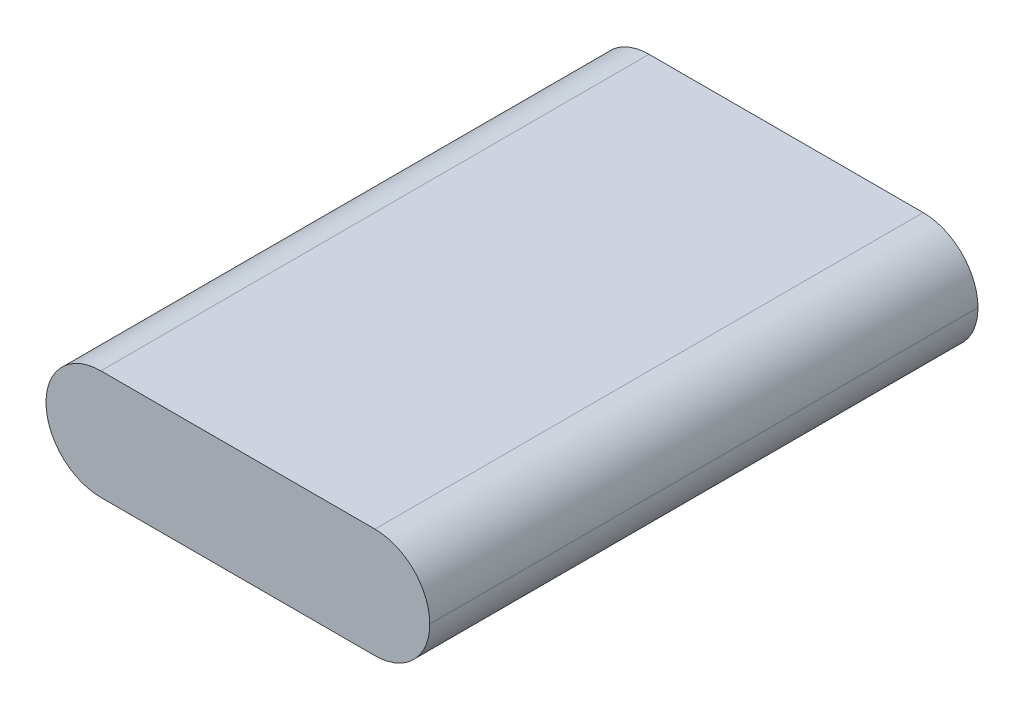
ISO-10303-21;
HEADER;
FILE_DESCRIPTION(('STEP AP214'),'2;1');
FILE_NAME('part.step','',(''),(''),'','','');
FILE_SCHEMA(('AUTOMOTIVE_DESIGN { 1 0 10303 214 1 1 1 1 }'));
ENDSEC;
DATA;
#1=APPLICATION_CONTEXT('core data for automotive mechanical design processes');
#2=APPLICATION_PROTOCOL_DEFINITION('international standard','automotive_design',2000,#1);
#3=PRODUCT_CONTEXT('',#1,'mechanical');
#4=PRODUCT('Part','Part','',(#3));
#5=PRODUCT_RELATED_PRODUCT_CATEGORY('part','',(#4));
#6=PRODUCT_DEFINITION_FORMATION('','',#4);
#7=PRODUCT_DEFINITION_CONTEXT('part definition',#1,'design');
#8=PRODUCT_DEFINITION('design','',#6,#7);
#9=PRODUCT_DEFINITION_SHAPE('','',#8);
#10=(LENGTH_UNIT() NAMED_UNIT(*) SI_UNIT(.MILLI.,.METRE.));
#11=(NAMED_UNIT(*) PLANE_ANGLE_UNIT() SI_UNIT($,.RADIAN.));
#12=(NAMED_UNIT(*) SI_UNIT($,.STERADIAN.) SOLID_ANGLE_UNIT());
#13=UNCERTAINTY_MEASURE_WITH_UNIT(LENGTH_MEASURE(1.E-05),#10,'distance_accuracy_value','');
#14=(GEOMETRIC_REPRESENTATION_CONTEXT(3) GLOBAL_UNCERTAINTY_ASSIGNED_CONTEXT((#13)) GLOBAL_UNIT_ASSIGNED_CONTEXT((#10,
#11,#12)) REPRESENTATION_CONTEXT('',''));
#15=CARTESIAN_POINT('',(0.,0.,0.));
#16=DIRECTION('',(0.,0.,1.));
#17=DIRECTION('',(1.,0.,0.));
#18=AXIS2_PLACEMENT_3D('',#15,#16,#17);
#19=CARTESIAN_POINT('',(17.5,10.,25.));
#20=DIRECTION('',(0.,0.,-1.));
#21=DIRECTION('',(-1.,0.,0.));
#22=AXIS2_PLACEMENT_3D('',#19,#20,#21);
#23=PLANE('',#22);
#24=CARTESIAN_POINT('',(-12.5,5.,25.));
#25=DIRECTION('',(0.,0.,-1.));
#26=DIRECTION('',(-1.,0.,0.));
#27=AXIS2_PLACEMENT_3D('',#24,#25,#26);
#28=CIRCLE('',#27,5.);
#29=CARTESIAN_POINT('',(-12.5,10.,25.));
#30=VERTEX_POINT('',#29);
#31=CARTESIAN_POINT('',(-17.5,5.,25.));
#32=VERTEX_POINT('',#31);
#33=EDGE_CURVE('E94',#30,#32,#28,.F.);
#34=ORIENTED_EDGE('',*,*,#33,.T.);
#35=CARTESIAN_POINT('',(-12.5,5.,25.));
#36=DIRECTION('',(0.,0.,-1.));
#37=DIRECTION('',(-1.,0.,0.));
#38=AXIS2_PLACEMENT_3D('',#35,#36,#37);
#39=CIRCLE('',#38,5.);
#40=CARTESIAN_POINT('',(-12.5,0.,25.));
#41=VERTEX_POINT('',#40);
#42=EDGE_CURVE('E89',#32,#41,#39,.F.);
#43=ORIENTED_EDGE('',*,*,#42,.T.);
#44=DIRECTION('',(1.,0.,0.));
#45=VECTOR('',#44,1.);
#46=CARTESIAN_POINT('',(17.5,0.,25.));
#47=LINE('',#46,#45);
#48=CARTESIAN_POINT('',(12.5,0.,25.));
#49=VERTEX_POINT('',#48);
#50=EDGE_CURVE('E91',#41,#49,#47,.T.);
#51=ORIENTED_EDGE('',*,*,#50,.T.);
#52=CARTESIAN_POINT('',(12.5,5.,25.));
#53=DIRECTION('',(0.,0.,-1.));
#54=DIRECTION('',(-1.,0.,0.));
#55=AXIS2_PLACEMENT_3D('',#52,#53,#54);
#56=CIRCLE('',#55,5.);
#57=CARTESIAN_POINT('',(17.5,5.,25.));
#58=VERTEX_POINT('',#57);
#59=EDGE_CURVE('E126',#49,#58,#56,.F.);
#60=ORIENTED_EDGE('',*,*,#59,.T.);
#61=CARTESIAN_POINT('',(12.5,5.,25.));
#62=DIRECTION('',(0.,0.,-1.));
#63=DIRECTION('',(-1.,0.,0.));
#64=AXIS2_PLACEMENT_3D('',#61,#62,#63);
#65=CIRCLE('',#64,5.);
#66=CARTESIAN_POINT('',(12.5,10.,25.));
#67=VERTEX_POINT('',#66);
#68=EDGE_CURVE('E130',#58,#67,#65,.F.);
#69=ORIENTED_EDGE('',*,*,#68,.T.);
#70=DIRECTION('',(1.,0.,0.));
#71=VECTOR('',#70,1.);
#72=CARTESIAN_POINT('',(17.5,10.,25.));
#73=LINE('',#72,#71);
#74=EDGE_CURVE('E135',#30,#67,#73,.T.);
#75=ORIENTED_EDGE('',*,*,#74,.F.);
#76=EDGE_LOOP('',(#34,#43,#51,#60,#69,#75));
#77=FACE_BOUND('',#76,.T.);
#78=ADVANCED_FACE('F35',(#77),#23,.F.);
#79=CARTESIAN_POINT('',(17.5,10.,-25.));
#80=DIRECTION('',(0.,0.,1.));
#81=DIRECTION('',(1.,0.,0.));
#82=AXIS2_PLACEMENT_3D('',#79,#80,#81);
#83=PLANE('',#82);
#84=DIRECTION('',(-1.,0.,0.));
#85=VECTOR('',#84,1.);
#86=CARTESIAN_POINT('',(17.5,0.,-25.));
#87=LINE('',#86,#85);
#88=CARTESIAN_POINT('',(12.5,0.,-25.));
#89=VERTEX_POINT('',#88);
#90=CARTESIAN_POINT('',(-12.5,0.,-25.));
#91=VERTEX_POINT('',#90);
#92=EDGE_CURVE('E109',#89,#91,#87,.T.);
#93=ORIENTED_EDGE('',*,*,#92,.T.);
#94=CARTESIAN_POINT('',(-12.5,5.,-25.));
#95=DIRECTION('',(0.,0.,1.));
#96=DIRECTION('',(1.,0.,0.));
#97=AXIS2_PLACEMENT_3D('',#94,#95,#96);
#98=CIRCLE('',#97,5.);
#99=CARTESIAN_POINT('',(-17.5,5.,-25.));
#100=VERTEX_POINT('',#99);
#101=EDGE_CURVE('E113',#91,#100,#98,.F.);
#102=ORIENTED_EDGE('',*,*,#101,.T.);
#103=CARTESIAN_POINT('',(-12.5,5.,-25.));
#104=DIRECTION('',(0.,0.,1.));
#105=DIRECTION('',(1.,0.,0.));
#106=AXIS2_PLACEMENT_3D('',#103,#104,#105);
#107=CIRCLE('',#106,5.);
#108=CARTESIAN_POINT('',(-12.5,10.,-25.));
#109=VERTEX_POINT('',#108);
#110=EDGE_CURVE('E58',#100,#109,#107,.F.);
#111=ORIENTED_EDGE('',*,*,#110,.T.);
#112=DIRECTION('',(-1.,0.,0.));
#113=VECTOR('',#112,1.);
#114=CARTESIAN_POINT('',(17.5,10.,-25.));
#115=LINE('',#114,#113);
#116=CARTESIAN_POINT('',(12.5,10.,-25.));
#117=VERTEX_POINT('',#116);
#118=EDGE_CURVE('E132',#117,#109,#115,.T.);
#119=ORIENTED_EDGE('',*,*,#118,.F.);
#120=CARTESIAN_POINT('',(12.5,5.,-25.));
#121=DIRECTION('',(0.,0.,1.));
#122=DIRECTION('',(1.,0.,0.));
#123=AXIS2_PLACEMENT_3D('',#120,#121,#122);
#124=CIRCLE('',#123,5.);
#125=CARTESIAN_POINT('',(17.5,5.,-25.));
#126=VERTEX_POINT('',#125);
#127=EDGE_CURVE('E52',#117,#126,#124,.F.);
#128=ORIENTED_EDGE('',*,*,#127,.T.);
#129=CARTESIAN_POINT('',(12.5,5.,-25.));
#130=DIRECTION('',(0.,0.,1.));
#131=DIRECTION('',(1.,0.,0.));
#132=AXIS2_PLACEMENT_3D('',#129,#130,#131);
#133=CIRCLE('',#132,5.);
#134=EDGE_CURVE('E115',#126,#89,#133,.F.);
#135=ORIENTED_EDGE('',*,*,#134,.T.);
#136=EDGE_LOOP('',(#93,#102,#111,#119,#128,#135));
#137=FACE_BOUND('',#136,.T.);
#138=ADVANCED_FACE('F154',(#137),#83,.F.);
#139=CARTESIAN_POINT('',(0.,10.,0.));
#140=DIRECTION('',(0.,1.,0.));
#141=DIRECTION('',(0.,0.,1.));
#142=AXIS2_PLACEMENT_3D('',#139,#140,#141);
#143=PLANE('',#142);
#144=ORIENTED_EDGE('',*,*,#118,.T.);
#145=DIRECTION('',(0.,0.,1.));
#146=VECTOR('',#145,1.);
#147=CARTESIAN_POINT('',(-12.5,10.,25.));
#148=LINE('',#147,#146);
#149=EDGE_CURVE('E11',#109,#30,#148,.T.);
#150=ORIENTED_EDGE('',*,*,#149,.T.);
#151=ORIENTED_EDGE('',*,*,#74,.T.);
#152=DIRECTION('',(0.,0.,-1.));
#153=VECTOR('',#152,1.);
#154=CARTESIAN_POINT('',(12.5,10.,-25.));
#155=LINE('',#154,#153);
#156=EDGE_CURVE('E44',#67,#117,#155,.T.);
#157=ORIENTED_EDGE('',*,*,#156,.T.);
#158=EDGE_LOOP('',(#144,#150,#151,#157));
#159=FACE_BOUND('',#158,.T.);
#160=ADVANCED_FACE('F141',(#159),#143,.T.);
#161=CARTESIAN_POINT('',(0.,0.,0.));
#162=DIRECTION('',(0.,1.,0.));
#163=DIRECTION('',(0.,0.,1.));
#164=AXIS2_PLACEMENT_3D('',#161,#162,#163);
#165=PLANE('',#164);
#166=ORIENTED_EDGE('',*,*,#50,.F.);
#167=DIRECTION('',(0.,0.,1.));
#168=VECTOR('',#167,1.);
#169=CARTESIAN_POINT('',(-12.5,0.,0.));
#170=LINE('',#169,#168);
#171=EDGE_CURVE('E106',#41,#91,#170,.F.);
#172=ORIENTED_EDGE('',*,*,#171,.T.);
#173=ORIENTED_EDGE('',*,*,#92,.F.);
#174=DIRECTION('',(0.,0.,-1.));
#175=VECTOR('',#174,1.);
#176=CARTESIAN_POINT('',(12.5,0.,0.));
#177=LINE('',#176,#175);
#178=EDGE_CURVE('E99',#89,#49,#177,.F.);
#179=ORIENTED_EDGE('',*,*,#178,.T.);
#180=EDGE_LOOP('',(#166,#172,#173,#179));
#181=FACE_BOUND('',#180,.T.);
#182=ADVANCED_FACE('F104',(#181),#165,.F.);
#183=CARTESIAN_POINT('',(-12.5,5.,0.));
#184=DIRECTION('',(0.,0.,-1.));
#185=DIRECTION('',(-1.,0.,0.));
#186=AXIS2_PLACEMENT_3D('',#183,#184,#185);
#187=CYLINDRICAL_SURFACE('',#186,5.);
#188=ORIENTED_EDGE('',*,*,#149,.F.);
#189=ORIENTED_EDGE('',*,*,#110,.F.);
#190=DIRECTION('',(0.,0.,1.));
#191=VECTOR('',#190,1.);
#192=CARTESIAN_POINT('',(-17.5,5.,-25.));
#193=LINE('',#192,#191);
#194=EDGE_CURVE('E110',#32,#100,#193,.F.);
#195=ORIENTED_EDGE('',*,*,#194,.F.);
#196=ORIENTED_EDGE('',*,*,#33,.F.);
#197=EDGE_LOOP('',(#188,#189,#195,#196));
#198=FACE_BOUND('',#197,.T.);
#199=ADVANCED_FACE('F144',(#198),#187,.T.);
#200=CARTESIAN_POINT('',(-12.5,5.,25.));
#201=DIRECTION('',(0.,0.,1.));
#202=DIRECTION('',(1.,0.,0.));
#203=AXIS2_PLACEMENT_3D('',#200,#201,#202);
#204=CYLINDRICAL_SURFACE('',#203,5.);
#205=ORIENTED_EDGE('',*,*,#101,.F.);
#206=ORIENTED_EDGE('',*,*,#171,.F.);
#207=ORIENTED_EDGE('',*,*,#42,.F.);
#208=ORIENTED_EDGE('',*,*,#194,.T.);
#209=EDGE_LOOP('',(#205,#206,#207,#208));
#210=FACE_BOUND('',#209,.T.);
#211=ADVANCED_FACE('F112',(#210),#204,.T.);
#212=CARTESIAN_POINT('',(12.5,5.,0.));
#213=DIRECTION('',(0.,0.,1.));
#214=DIRECTION('',(1.,0.,0.));
#215=AXIS2_PLACEMENT_3D('',#212,#213,#214);
#216=CYLINDRICAL_SURFACE('',#215,5.);
#217=ORIENTED_EDGE('',*,*,#156,.F.);
#218=ORIENTED_EDGE('',*,*,#68,.F.);
#219=DIRECTION('',(0.,0.,-1.));
#220=VECTOR('',#219,1.);
#221=CARTESIAN_POINT('',(17.5,5.,25.));
#222=LINE('',#221,#220);
#223=EDGE_CURVE('E39',#126,#58,#222,.F.);
#224=ORIENTED_EDGE('',*,*,#223,.F.);
#225=ORIENTED_EDGE('',*,*,#127,.F.);
#226=EDGE_LOOP('',(#217,#218,#224,#225));
#227=FACE_BOUND('',#226,.T.);
#228=ADVANCED_FACE('F37',(#227),#216,.T.);
#229=CARTESIAN_POINT('',(12.5,5.,25.));
#230=DIRECTION('',(0.,0.,-1.));
#231=DIRECTION('',(-1.,0.,0.));
#232=AXIS2_PLACEMENT_3D('',#229,#230,#231);
#233=CYLINDRICAL_SURFACE('',#232,5.);
#234=ORIENTED_EDGE('',*,*,#59,.F.);
#235=ORIENTED_EDGE('',*,*,#178,.F.);
#236=ORIENTED_EDGE('',*,*,#134,.F.);
#237=ORIENTED_EDGE('',*,*,#223,.T.);
#238=EDGE_LOOP('',(#234,#235,#236,#237));
#239=FACE_BOUND('',#238,.T.);
#240=ADVANCED_FACE('F125',(#239),#233,.T.);
#241=CLOSED_SHELL('',(#78,#138,#160,#182,#199,#211,#228,#240));
#242=MANIFOLD_SOLID_BREP('B2',#241);
#243=ADVANCED_BREP_SHAPE_REPRESENTATION('',(#18,#242),#14);
#244=SHAPE_DEFINITION_REPRESENTATION(#9,#243);
ENDSEC;
END-ISO-10303-21;
